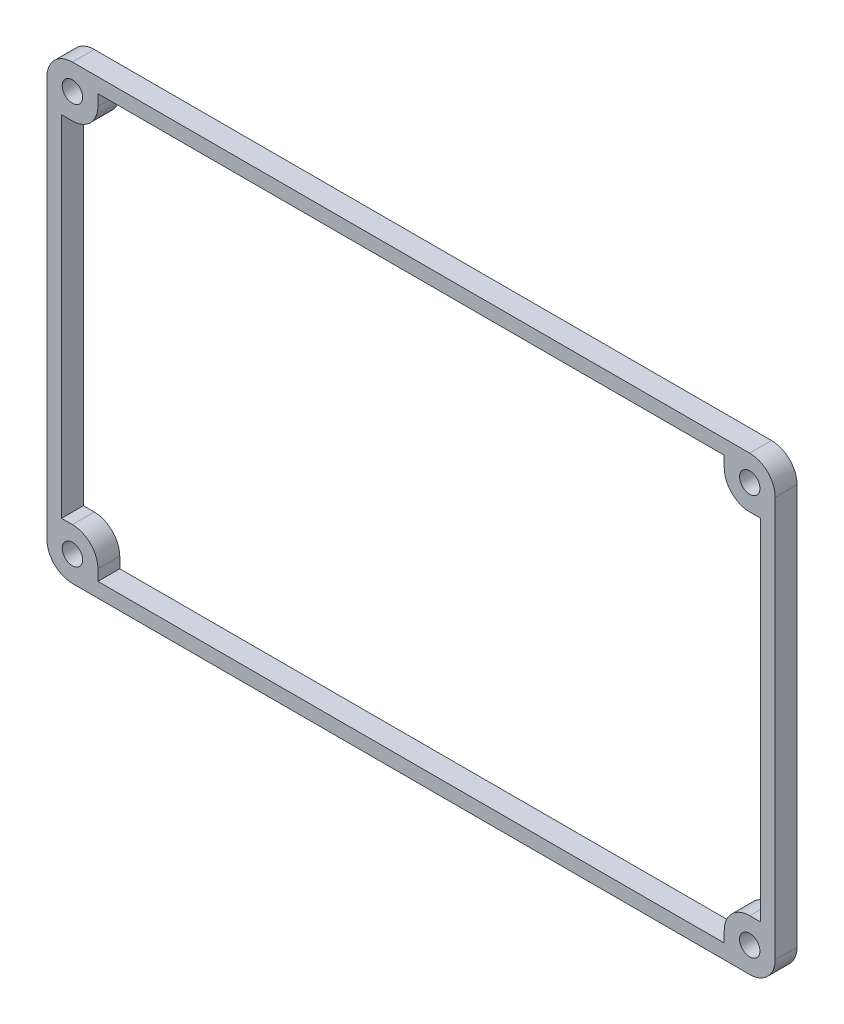
ISO-10303-21;
HEADER;
FILE_DESCRIPTION(('STEP AP214'),'2;1');
FILE_NAME('part.step','',(''),(''),'','','');
FILE_SCHEMA(('AUTOMOTIVE_DESIGN { 1 0 10303 214 1 1 1 1 }'));
ENDSEC;
DATA;
#1=APPLICATION_CONTEXT('core data for automotive mechanical design processes');
#2=APPLICATION_PROTOCOL_DEFINITION('international standard','automotive_design',2000,#1);
#3=PRODUCT_CONTEXT('',#1,'mechanical');
#4=PRODUCT('Part','Part','',(#3));
#5=PRODUCT_RELATED_PRODUCT_CATEGORY('part','',(#4));
#6=PRODUCT_DEFINITION_FORMATION('','',#4);
#7=PRODUCT_DEFINITION_CONTEXT('part definition',#1,'design');
#8=PRODUCT_DEFINITION('design','',#6,#7);
#9=PRODUCT_DEFINITION_SHAPE('','',#8);
#10=(LENGTH_UNIT() NAMED_UNIT(*) SI_UNIT(.MILLI.,.METRE.));
#11=(NAMED_UNIT(*) PLANE_ANGLE_UNIT() SI_UNIT($,.RADIAN.));
#12=(NAMED_UNIT(*) SI_UNIT($,.STERADIAN.) SOLID_ANGLE_UNIT());
#13=UNCERTAINTY_MEASURE_WITH_UNIT(LENGTH_MEASURE(1.E-05),#10,'distance_accuracy_value','');
#14=(GEOMETRIC_REPRESENTATION_CONTEXT(3) GLOBAL_UNCERTAINTY_ASSIGNED_CONTEXT((#13)) GLOBAL_UNIT_ASSIGNED_CONTEXT((#10,
#11,#12)) REPRESENTATION_CONTEXT('',''));
#15=CARTESIAN_POINT('',(0.,0.,0.));
#16=DIRECTION('',(0.,0.,1.));
#17=DIRECTION('',(1.,0.,0.));
#18=AXIS2_PLACEMENT_3D('',#15,#16,#17);
#19=CARTESIAN_POINT('',(-46.5,-27.5,3.));
#20=DIRECTION('',(0.,0.,-1.));
#21=DIRECTION('',(-1.,0.,0.));
#22=AXIS2_PLACEMENT_3D('',#19,#20,#21);
#23=PLANE('',#22);
#24=CARTESIAN_POINT('',(-46.5,-27.5,3.));
#25=DIRECTION('',(0.,0.,1.));
#26=DIRECTION('',(1.,0.,0.));
#27=AXIS2_PLACEMENT_3D('',#24,#25,#26);
#28=CIRCLE('',#27,1.4);
#29=CARTESIAN_POINT('',(-45.1,-27.5,3.));
#30=VERTEX_POINT('',#29);
#31=EDGE_CURVE('E295',#30,#30,#28,.T.);
#32=ORIENTED_EDGE('',*,*,#31,.F.);
#33=EDGE_LOOP('',(#32));
#34=FACE_BOUND('',#33,.T.);
#35=CARTESIAN_POINT('',(46.5,-27.5,3.));
#36=DIRECTION('',(0.,0.,1.));
#37=DIRECTION('',(1.,0.,0.));
#38=AXIS2_PLACEMENT_3D('',#35,#36,#37);
#39=CIRCLE('',#38,1.4);
#40=CARTESIAN_POINT('',(47.9,-27.5,3.));
#41=VERTEX_POINT('',#40);
#42=EDGE_CURVE('E301',#41,#41,#39,.T.);
#43=ORIENTED_EDGE('',*,*,#42,.F.);
#44=EDGE_LOOP('',(#43));
#45=FACE_BOUND('',#44,.T.);
#46=CARTESIAN_POINT('',(46.5,27.5,3.));
#47=DIRECTION('',(0.,0.,1.));
#48=DIRECTION('',(1.,0.,0.));
#49=AXIS2_PLACEMENT_3D('',#46,#47,#48);
#50=CIRCLE('',#49,1.4);
#51=CARTESIAN_POINT('',(47.9,27.5,3.));
#52=VERTEX_POINT('',#51);
#53=EDGE_CURVE('E307',#52,#52,#50,.T.);
#54=ORIENTED_EDGE('',*,*,#53,.F.);
#55=EDGE_LOOP('',(#54));
#56=FACE_BOUND('',#55,.T.);
#57=CARTESIAN_POINT('',(-46.5,27.5,3.));
#58=DIRECTION('',(0.,0.,1.));
#59=DIRECTION('',(1.,0.,0.));
#60=AXIS2_PLACEMENT_3D('',#57,#58,#59);
#61=CIRCLE('',#60,1.4);
#62=CARTESIAN_POINT('',(-45.1,27.5,3.));
#63=VERTEX_POINT('',#62);
#64=EDGE_CURVE('E313',#63,#63,#61,.T.);
#65=ORIENTED_EDGE('',*,*,#64,.F.);
#66=EDGE_LOOP('',(#65));
#67=FACE_BOUND('',#66,.T.);
#68=CARTESIAN_POINT('',(-46.5,-27.5,3.));
#69=DIRECTION('',(0.,0.,1.));
#70=DIRECTION('',(-1.,0.,0.));
#71=AXIS2_PLACEMENT_3D('',#68,#69,#70);
#72=CIRCLE('',#71,3.5);
#73=CARTESIAN_POINT('',(-50.,-27.5,3.));
#74=VERTEX_POINT('',#73);
#75=CARTESIAN_POINT('',(-46.5,-31.,3.));
#76=VERTEX_POINT('',#75);
#77=EDGE_CURVE('E319',#74,#76,#72,.T.);
#78=ORIENTED_EDGE('',*,*,#77,.T.);
#79=DIRECTION('',(1.,0.,0.));
#80=VECTOR('',#79,1.);
#81=CARTESIAN_POINT('',(-46.5,-31.,3.));
#82=LINE('',#81,#80);
#83=CARTESIAN_POINT('',(46.5,-31.,3.));
#84=VERTEX_POINT('',#83);
#85=EDGE_CURVE('E322',#76,#84,#82,.T.);
#86=ORIENTED_EDGE('',*,*,#85,.T.);
#87=CARTESIAN_POINT('',(46.5,-27.5,3.));
#88=DIRECTION('',(0.,0.,1.));
#89=DIRECTION('',(1.,0.,0.));
#90=AXIS2_PLACEMENT_3D('',#87,#88,#89);
#91=CIRCLE('',#90,3.5);
#92=CARTESIAN_POINT('',(50.,-27.5,3.));
#93=VERTEX_POINT('',#92);
#94=EDGE_CURVE('E325',#84,#93,#91,.T.);
#95=ORIENTED_EDGE('',*,*,#94,.T.);
#96=DIRECTION('',(0.,1.,0.));
#97=VECTOR('',#96,1.);
#98=CARTESIAN_POINT('',(50.,-27.5,3.));
#99=LINE('',#98,#97);
#100=CARTESIAN_POINT('',(50.,27.5,3.));
#101=VERTEX_POINT('',#100);
#102=EDGE_CURVE('E327',#93,#101,#99,.T.);
#103=ORIENTED_EDGE('',*,*,#102,.T.);
#104=CARTESIAN_POINT('',(46.5,27.5,3.));
#105=DIRECTION('',(0.,0.,1.));
#106=DIRECTION('',(-1.,0.,0.));
#107=AXIS2_PLACEMENT_3D('',#104,#105,#106);
#108=CIRCLE('',#107,3.5);
#109=CARTESIAN_POINT('',(46.5,31.,3.));
#110=VERTEX_POINT('',#109);
#111=EDGE_CURVE('E329',#101,#110,#108,.T.);
#112=ORIENTED_EDGE('',*,*,#111,.T.);
#113=DIRECTION('',(-1.,0.,0.));
#114=VECTOR('',#113,1.);
#115=CARTESIAN_POINT('',(-46.5,31.,3.));
#116=LINE('',#115,#114);
#117=CARTESIAN_POINT('',(-46.5,31.,3.));
#118=VERTEX_POINT('',#117);
#119=EDGE_CURVE('E331',#110,#118,#116,.T.);
#120=ORIENTED_EDGE('',*,*,#119,.T.);
#121=CARTESIAN_POINT('',(-46.5,27.5,3.));
#122=DIRECTION('',(0.,0.,1.));
#123=DIRECTION('',(-1.,0.,0.));
#124=AXIS2_PLACEMENT_3D('',#121,#122,#123);
#125=CIRCLE('',#124,3.5);
#126=CARTESIAN_POINT('',(-50.,27.5,3.));
#127=VERTEX_POINT('',#126);
#128=EDGE_CURVE('E333',#118,#127,#125,.T.);
#129=ORIENTED_EDGE('',*,*,#128,.T.);
#130=DIRECTION('',(0.,-1.,0.));
#131=VECTOR('',#130,1.);
#132=CARTESIAN_POINT('',(-50.,-27.5,3.));
#133=LINE('',#132,#131);
#134=EDGE_CURVE('E335',#127,#74,#133,.T.);
#135=ORIENTED_EDGE('',*,*,#134,.T.);
#136=EDGE_LOOP('',(#78,#86,#95,#103,#112,#120,#129,#135));
#137=FACE_BOUND('',#136,.T.);
#138=DIRECTION('',(0.,1.,0.));
#139=VECTOR('',#138,1.);
#140=CARTESIAN_POINT('',(-43.,0.,3.));
#141=LINE('',#140,#139);
#142=CARTESIAN_POINT('',(-43.,-29.,3.));
#143=VERTEX_POINT('',#142);
#144=CARTESIAN_POINT('',(-43.,-27.5,3.));
#145=VERTEX_POINT('',#144);
#146=EDGE_CURVE('E257',#143,#145,#141,.T.);
#147=ORIENTED_EDGE('',*,*,#146,.T.);
#148=CARTESIAN_POINT('',(-46.5,-27.5,3.));
#149=DIRECTION('',(0.,0.,-1.));
#150=DIRECTION('',(-1.,0.,0.));
#151=AXIS2_PLACEMENT_3D('',#148,#149,#150);
#152=CIRCLE('',#151,3.5);
#153=CARTESIAN_POINT('',(-46.5,-24.,3.));
#154=VERTEX_POINT('',#153);
#155=EDGE_CURVE('E385',#145,#154,#152,.F.);
#156=ORIENTED_EDGE('',*,*,#155,.T.);
#157=DIRECTION('',(1.,0.,0.));
#158=VECTOR('',#157,1.);
#159=CARTESIAN_POINT('',(0.,-24.,3.));
#160=LINE('',#159,#158);
#161=CARTESIAN_POINT('',(-48.,-24.,3.));
#162=VERTEX_POINT('',#161);
#163=EDGE_CURVE('E254',#162,#154,#160,.T.);
#164=ORIENTED_EDGE('',*,*,#163,.F.);
#165=DIRECTION('',(0.,1.,0.));
#166=VECTOR('',#165,1.);
#167=CARTESIAN_POINT('',(-48.,0.,3.));
#168=LINE('',#167,#166);
#169=CARTESIAN_POINT('',(-48.,24.,3.));
#170=VERTEX_POINT('',#169);
#171=EDGE_CURVE('E252',#162,#170,#168,.T.);
#172=ORIENTED_EDGE('',*,*,#171,.T.);
#173=DIRECTION('',(1.,0.,0.));
#174=VECTOR('',#173,1.);
#175=CARTESIAN_POINT('',(0.,24.,3.));
#176=LINE('',#175,#174);
#177=CARTESIAN_POINT('',(-46.5,24.,3.));
#178=VERTEX_POINT('',#177);
#179=EDGE_CURVE('E216',#170,#178,#176,.T.);
#180=ORIENTED_EDGE('',*,*,#179,.T.);
#181=CARTESIAN_POINT('',(-46.5,27.5,3.));
#182=DIRECTION('',(0.,0.,-1.));
#183=DIRECTION('',(-1.,0.,0.));
#184=AXIS2_PLACEMENT_3D('',#181,#182,#183);
#185=CIRCLE('',#184,3.5);
#186=CARTESIAN_POINT('',(-43.,27.5,3.));
#187=VERTEX_POINT('',#186);
#188=EDGE_CURVE('E379',#178,#187,#185,.F.);
#189=ORIENTED_EDGE('',*,*,#188,.T.);
#190=DIRECTION('',(0.,1.,0.));
#191=VECTOR('',#190,1.);
#192=CARTESIAN_POINT('',(-43.,0.,3.));
#193=LINE('',#192,#191);
#194=CARTESIAN_POINT('',(-43.,29.,3.));
#195=VERTEX_POINT('',#194);
#196=EDGE_CURVE('E223',#187,#195,#193,.T.);
#197=ORIENTED_EDGE('',*,*,#196,.T.);
#198=DIRECTION('',(1.,0.,0.));
#199=VECTOR('',#198,1.);
#200=CARTESIAN_POINT('',(0.,29.,3.));
#201=LINE('',#200,#199);
#202=CARTESIAN_POINT('',(43.,29.,3.));
#203=VERTEX_POINT('',#202);
#204=EDGE_CURVE('E225',#195,#203,#201,.T.);
#205=ORIENTED_EDGE('',*,*,#204,.T.);
#206=DIRECTION('',(0.,1.,0.));
#207=VECTOR('',#206,1.);
#208=CARTESIAN_POINT('',(43.,0.,3.));
#209=LINE('',#208,#207);
#210=CARTESIAN_POINT('',(43.,27.5,3.));
#211=VERTEX_POINT('',#210);
#212=EDGE_CURVE('E273',#211,#203,#209,.T.);
#213=ORIENTED_EDGE('',*,*,#212,.F.);
#214=CARTESIAN_POINT('',(46.5,27.5,3.));
#215=DIRECTION('',(0.,0.,-1.));
#216=DIRECTION('',(-1.,0.,0.));
#217=AXIS2_PLACEMENT_3D('',#214,#215,#216);
#218=CIRCLE('',#217,3.5);
#219=CARTESIAN_POINT('',(46.5,24.,3.));
#220=VERTEX_POINT('',#219);
#221=EDGE_CURVE('E381',#211,#220,#218,.F.);
#222=ORIENTED_EDGE('',*,*,#221,.T.);
#223=DIRECTION('',(1.,0.,0.));
#224=VECTOR('',#223,1.);
#225=CARTESIAN_POINT('',(0.,24.,3.));
#226=LINE('',#225,#224);
#227=CARTESIAN_POINT('',(48.,24.,3.));
#228=VERTEX_POINT('',#227);
#229=EDGE_CURVE('E271',#220,#228,#226,.T.);
#230=ORIENTED_EDGE('',*,*,#229,.T.);
#231=DIRECTION('',(0.,1.,0.));
#232=VECTOR('',#231,1.);
#233=CARTESIAN_POINT('',(48.,0.,3.));
#234=LINE('',#233,#232);
#235=CARTESIAN_POINT('',(48.,-24.,3.));
#236=VERTEX_POINT('',#235);
#237=EDGE_CURVE('E268',#236,#228,#234,.T.);
#238=ORIENTED_EDGE('',*,*,#237,.F.);
#239=DIRECTION('',(1.,0.,0.));
#240=VECTOR('',#239,1.);
#241=CARTESIAN_POINT('',(0.,-24.,3.));
#242=LINE('',#241,#240);
#243=CARTESIAN_POINT('',(46.5,-24.,3.));
#244=VERTEX_POINT('',#243);
#245=EDGE_CURVE('E266',#244,#236,#242,.T.);
#246=ORIENTED_EDGE('',*,*,#245,.F.);
#247=CARTESIAN_POINT('',(46.5,-27.5,3.));
#248=DIRECTION('',(0.,0.,-1.));
#249=DIRECTION('',(-1.,0.,0.));
#250=AXIS2_PLACEMENT_3D('',#247,#248,#249);
#251=CIRCLE('',#250,3.5);
#252=CARTESIAN_POINT('',(43.,-27.5,3.));
#253=VERTEX_POINT('',#252);
#254=EDGE_CURVE('E383',#244,#253,#251,.F.);
#255=ORIENTED_EDGE('',*,*,#254,.T.);
#256=DIRECTION('',(0.,1.,0.));
#257=VECTOR('',#256,1.);
#258=CARTESIAN_POINT('',(43.,0.,3.));
#259=LINE('',#258,#257);
#260=CARTESIAN_POINT('',(43.,-29.,3.));
#261=VERTEX_POINT('',#260);
#262=EDGE_CURVE('E263',#261,#253,#259,.T.);
#263=ORIENTED_EDGE('',*,*,#262,.F.);
#264=DIRECTION('',(1.,0.,0.));
#265=VECTOR('',#264,1.);
#266=CARTESIAN_POINT('',(0.,-29.,3.));
#267=LINE('',#266,#265);
#268=EDGE_CURVE('E260',#143,#261,#267,.T.);
#269=ORIENTED_EDGE('',*,*,#268,.F.);
#270=EDGE_LOOP('',(#147,#156,#164,#172,#180,#189,#197,#205,#213,#222,#230,#238,#246,#255,#263,#269));
#271=FACE_BOUND('',#270,.T.);
#272=ADVANCED_FACE('F36',(#34,#45,#56,#67,#137,#271),#23,.F.);
#273=CARTESIAN_POINT('',(-46.5,-27.5,0.));
#274=DIRECTION('',(0.,0.,-1.));
#275=DIRECTION('',(-1.,0.,0.));
#276=AXIS2_PLACEMENT_3D('',#273,#274,#275);
#277=PLANE('',#276);
#278=CARTESIAN_POINT('',(46.5,-27.5,0.));
#279=DIRECTION('',(0.,0.,1.));
#280=DIRECTION('',(1.,0.,0.));
#281=AXIS2_PLACEMENT_3D('',#278,#279,#280);
#282=CIRCLE('',#281,1.4);
#283=CARTESIAN_POINT('',(47.9,-27.5,0.));
#284=VERTEX_POINT('',#283);
#285=EDGE_CURVE('E298',#284,#284,#282,.T.);
#286=ORIENTED_EDGE('',*,*,#285,.T.);
#287=EDGE_LOOP('',(#286));
#288=FACE_BOUND('',#287,.T.);
#289=CARTESIAN_POINT('',(-46.5,27.5,0.));
#290=DIRECTION('',(0.,0.,1.));
#291=DIRECTION('',(1.,0.,0.));
#292=AXIS2_PLACEMENT_3D('',#289,#290,#291);
#293=CIRCLE('',#292,1.4);
#294=CARTESIAN_POINT('',(-45.1,27.5,0.));
#295=VERTEX_POINT('',#294);
#296=EDGE_CURVE('E310',#295,#295,#293,.T.);
#297=ORIENTED_EDGE('',*,*,#296,.T.);
#298=EDGE_LOOP('',(#297));
#299=FACE_BOUND('',#298,.T.);
#300=CARTESIAN_POINT('',(-46.5,-27.5,0.));
#301=DIRECTION('',(0.,0.,1.));
#302=DIRECTION('',(-1.,0.,0.));
#303=AXIS2_PLACEMENT_3D('',#300,#301,#302);
#304=CIRCLE('',#303,3.5);
#305=CARTESIAN_POINT('',(-50.,-27.5,0.));
#306=VERTEX_POINT('',#305);
#307=CARTESIAN_POINT('',(-46.5,-31.,0.));
#308=VERTEX_POINT('',#307);
#309=EDGE_CURVE('E316',#306,#308,#304,.T.);
#310=ORIENTED_EDGE('',*,*,#309,.F.);
#311=DIRECTION('',(0.,-1.,0.));
#312=VECTOR('',#311,1.);
#313=CARTESIAN_POINT('',(-50.,-27.5,0.));
#314=LINE('',#313,#312);
#315=CARTESIAN_POINT('',(-50.,27.5,0.));
#316=VERTEX_POINT('',#315);
#317=EDGE_CURVE('E323',#316,#306,#314,.T.);
#318=ORIENTED_EDGE('',*,*,#317,.F.);
#319=CARTESIAN_POINT('',(-46.5,27.5,0.));
#320=DIRECTION('',(0.,0.,1.));
#321=DIRECTION('',(-1.,0.,0.));
#322=AXIS2_PLACEMENT_3D('',#319,#320,#321);
#323=CIRCLE('',#322,3.5);
#324=CARTESIAN_POINT('',(-46.5,31.,0.));
#325=VERTEX_POINT('',#324);
#326=EDGE_CURVE('E350',#325,#316,#323,.T.);
#327=ORIENTED_EDGE('',*,*,#326,.F.);
#328=DIRECTION('',(-1.,0.,0.));
#329=VECTOR('',#328,1.);
#330=CARTESIAN_POINT('',(-46.5,31.,0.));
#331=LINE('',#330,#329);
#332=CARTESIAN_POINT('',(46.5,31.,0.));
#333=VERTEX_POINT('',#332);
#334=EDGE_CURVE('E348',#333,#325,#331,.T.);
#335=ORIENTED_EDGE('',*,*,#334,.F.);
#336=CARTESIAN_POINT('',(46.5,27.5,0.));
#337=DIRECTION('',(0.,0.,1.));
#338=DIRECTION('',(-1.,0.,0.));
#339=AXIS2_PLACEMENT_3D('',#336,#337,#338);
#340=CIRCLE('',#339,3.5);
#341=CARTESIAN_POINT('',(50.,27.5,0.));
#342=VERTEX_POINT('',#341);
#343=EDGE_CURVE('E346',#342,#333,#340,.T.);
#344=ORIENTED_EDGE('',*,*,#343,.F.);
#345=DIRECTION('',(0.,1.,0.));
#346=VECTOR('',#345,1.);
#347=CARTESIAN_POINT('',(50.,-27.5,0.));
#348=LINE('',#347,#346);
#349=CARTESIAN_POINT('',(50.,-27.5,0.));
#350=VERTEX_POINT('',#349);
#351=EDGE_CURVE('E344',#350,#342,#348,.T.);
#352=ORIENTED_EDGE('',*,*,#351,.F.);
#353=CARTESIAN_POINT('',(46.5,-27.5,0.));
#354=DIRECTION('',(0.,0.,1.));
#355=DIRECTION('',(1.,0.,0.));
#356=AXIS2_PLACEMENT_3D('',#353,#354,#355);
#357=CIRCLE('',#356,3.5);
#358=CARTESIAN_POINT('',(46.5,-31.,0.));
#359=VERTEX_POINT('',#358);
#360=EDGE_CURVE('E342',#359,#350,#357,.T.);
#361=ORIENTED_EDGE('',*,*,#360,.F.);
#362=DIRECTION('',(1.,0.,0.));
#363=VECTOR('',#362,1.);
#364=CARTESIAN_POINT('',(-46.5,-31.,0.));
#365=LINE('',#364,#363);
#366=EDGE_CURVE('E340',#308,#359,#365,.T.);
#367=ORIENTED_EDGE('',*,*,#366,.F.);
#368=EDGE_LOOP('',(#310,#318,#327,#335,#344,#352,#361,#367));
#369=FACE_BOUND('',#368,.T.);
#370=CARTESIAN_POINT('',(46.5,27.5,0.));
#371=DIRECTION('',(0.,0.,1.));
#372=DIRECTION('',(1.,0.,0.));
#373=AXIS2_PLACEMENT_3D('',#370,#371,#372);
#374=CIRCLE('',#373,1.4);
#375=CARTESIAN_POINT('',(47.9,27.5,0.));
#376=VERTEX_POINT('',#375);
#377=EDGE_CURVE('E304',#376,#376,#374,.T.);
#378=ORIENTED_EDGE('',*,*,#377,.T.);
#379=EDGE_LOOP('',(#378));
#380=FACE_BOUND('',#379,.T.);
#381=CARTESIAN_POINT('',(-46.5,-27.5,0.));
#382=DIRECTION('',(0.,0.,1.));
#383=DIRECTION('',(1.,0.,0.));
#384=AXIS2_PLACEMENT_3D('',#381,#382,#383);
#385=CIRCLE('',#384,1.4);
#386=CARTESIAN_POINT('',(-45.1,-27.5,0.));
#387=VERTEX_POINT('',#386);
#388=EDGE_CURVE('E280',#387,#387,#385,.T.);
#389=ORIENTED_EDGE('',*,*,#388,.T.);
#390=EDGE_LOOP('',(#389));
#391=FACE_BOUND('',#390,.T.);
#392=DIRECTION('',(1.,0.,0.));
#393=VECTOR('',#392,1.);
#394=CARTESIAN_POINT('',(0.,-24.,0.));
#395=LINE('',#394,#393);
#396=CARTESIAN_POINT('',(-48.,-24.,0.));
#397=VERTEX_POINT('',#396);
#398=CARTESIAN_POINT('',(-46.5,-24.,0.));
#399=VERTEX_POINT('',#398);
#400=EDGE_CURVE('E207',#397,#399,#395,.T.);
#401=ORIENTED_EDGE('',*,*,#400,.T.);
#402=CARTESIAN_POINT('',(-46.5,-27.5,0.));
#403=DIRECTION('',(0.,0.,-1.));
#404=DIRECTION('',(-1.,0.,0.));
#405=AXIS2_PLACEMENT_3D('',#402,#403,#404);
#406=CIRCLE('',#405,3.5);
#407=CARTESIAN_POINT('',(-43.,-27.5,0.));
#408=VERTEX_POINT('',#407);
#409=EDGE_CURVE('E393',#399,#408,#406,.T.);
#410=ORIENTED_EDGE('',*,*,#409,.T.);
#411=DIRECTION('',(0.,1.,0.));
#412=VECTOR('',#411,1.);
#413=CARTESIAN_POINT('',(-43.,0.,0.));
#414=LINE('',#413,#412);
#415=CARTESIAN_POINT('',(-43.,-29.,0.));
#416=VERTEX_POINT('',#415);
#417=EDGE_CURVE('E229',#416,#408,#414,.T.);
#418=ORIENTED_EDGE('',*,*,#417,.F.);
#419=DIRECTION('',(1.,0.,0.));
#420=VECTOR('',#419,1.);
#421=CARTESIAN_POINT('',(0.,-29.,0.));
#422=LINE('',#421,#420);
#423=CARTESIAN_POINT('',(43.,-29.,0.));
#424=VERTEX_POINT('',#423);
#425=EDGE_CURVE('E232',#416,#424,#422,.T.);
#426=ORIENTED_EDGE('',*,*,#425,.T.);
#427=DIRECTION('',(0.,1.,0.));
#428=VECTOR('',#427,1.);
#429=CARTESIAN_POINT('',(43.,0.,0.));
#430=LINE('',#429,#428);
#431=CARTESIAN_POINT('',(43.,-27.5,0.));
#432=VERTEX_POINT('',#431);
#433=EDGE_CURVE('E235',#424,#432,#430,.T.);
#434=ORIENTED_EDGE('',*,*,#433,.T.);
#435=CARTESIAN_POINT('',(46.5,-27.5,0.));
#436=DIRECTION('',(0.,0.,-1.));
#437=DIRECTION('',(-1.,0.,0.));
#438=AXIS2_PLACEMENT_3D('',#435,#436,#437);
#439=CIRCLE('',#438,3.5);
#440=CARTESIAN_POINT('',(46.5,-24.,0.));
#441=VERTEX_POINT('',#440);
#442=EDGE_CURVE('E391',#432,#441,#439,.T.);
#443=ORIENTED_EDGE('',*,*,#442,.T.);
#444=DIRECTION('',(1.,0.,0.));
#445=VECTOR('',#444,1.);
#446=CARTESIAN_POINT('',(0.,-24.,0.));
#447=LINE('',#446,#445);
#448=CARTESIAN_POINT('',(48.,-24.,0.));
#449=VERTEX_POINT('',#448);
#450=EDGE_CURVE('E238',#441,#449,#447,.T.);
#451=ORIENTED_EDGE('',*,*,#450,.T.);
#452=DIRECTION('',(0.,1.,0.));
#453=VECTOR('',#452,1.);
#454=CARTESIAN_POINT('',(48.,0.,0.));
#455=LINE('',#454,#453);
#456=CARTESIAN_POINT('',(48.,24.,0.));
#457=VERTEX_POINT('',#456);
#458=EDGE_CURVE('E240',#449,#457,#455,.T.);
#459=ORIENTED_EDGE('',*,*,#458,.T.);
#460=DIRECTION('',(1.,0.,0.));
#461=VECTOR('',#460,1.);
#462=CARTESIAN_POINT('',(0.,24.,0.));
#463=LINE('',#462,#461);
#464=CARTESIAN_POINT('',(46.5,24.,0.));
#465=VERTEX_POINT('',#464);
#466=EDGE_CURVE('E243',#465,#457,#463,.T.);
#467=ORIENTED_EDGE('',*,*,#466,.F.);
#468=CARTESIAN_POINT('',(46.5,27.5,0.));
#469=DIRECTION('',(0.,0.,-1.));
#470=DIRECTION('',(-1.,0.,0.));
#471=AXIS2_PLACEMENT_3D('',#468,#469,#470);
#472=CIRCLE('',#471,3.5);
#473=CARTESIAN_POINT('',(43.,27.5,0.));
#474=VERTEX_POINT('',#473);
#475=EDGE_CURVE('E51',#465,#474,#472,.T.);
#476=ORIENTED_EDGE('',*,*,#475,.T.);
#477=DIRECTION('',(0.,1.,0.));
#478=VECTOR('',#477,1.);
#479=CARTESIAN_POINT('',(43.,0.,0.));
#480=LINE('',#479,#478);
#481=CARTESIAN_POINT('',(43.,29.,0.));
#482=VERTEX_POINT('',#481);
#483=EDGE_CURVE('E245',#474,#482,#480,.T.);
#484=ORIENTED_EDGE('',*,*,#483,.T.);
#485=DIRECTION('',(1.,0.,0.));
#486=VECTOR('',#485,1.);
#487=CARTESIAN_POINT('',(0.,29.,0.));
#488=LINE('',#487,#486);
#489=CARTESIAN_POINT('',(-43.,29.,0.));
#490=VERTEX_POINT('',#489);
#491=EDGE_CURVE('E247',#490,#482,#488,.T.);
#492=ORIENTED_EDGE('',*,*,#491,.F.);
#493=DIRECTION('',(0.,1.,0.));
#494=VECTOR('',#493,1.);
#495=CARTESIAN_POINT('',(-43.,0.,0.));
#496=LINE('',#495,#494);
#497=CARTESIAN_POINT('',(-43.,27.5,0.));
#498=VERTEX_POINT('',#497);
#499=EDGE_CURVE('E217',#498,#490,#496,.T.);
#500=ORIENTED_EDGE('',*,*,#499,.F.);
#501=CARTESIAN_POINT('',(-46.5,27.5,0.));
#502=DIRECTION('',(0.,0.,-1.));
#503=DIRECTION('',(-1.,0.,0.));
#504=AXIS2_PLACEMENT_3D('',#501,#502,#503);
#505=CIRCLE('',#504,3.5);
#506=CARTESIAN_POINT('',(-46.5,24.,0.));
#507=VERTEX_POINT('',#506);
#508=EDGE_CURVE('E222',#498,#507,#505,.T.);
#509=ORIENTED_EDGE('',*,*,#508,.T.);
#510=DIRECTION('',(1.,0.,0.));
#511=VECTOR('',#510,1.);
#512=CARTESIAN_POINT('',(0.,24.,0.));
#513=LINE('',#512,#511);
#514=CARTESIAN_POINT('',(-48.,24.,0.));
#515=VERTEX_POINT('',#514);
#516=EDGE_CURVE('E208',#515,#507,#513,.T.);
#517=ORIENTED_EDGE('',*,*,#516,.F.);
#518=DIRECTION('',(0.,1.,0.));
#519=VECTOR('',#518,1.);
#520=CARTESIAN_POINT('',(-48.,0.,0.));
#521=LINE('',#520,#519);
#522=EDGE_CURVE('E198',#397,#515,#521,.T.);
#523=ORIENTED_EDGE('',*,*,#522,.F.);
#524=EDGE_LOOP('',(#401,#410,#418,#426,#434,#443,#451,#459,#467,#476,#484,#492,#500,#509,#517,#523));
#525=FACE_BOUND('',#524,.T.);
#526=ADVANCED_FACE('F219',(#288,#299,#369,#380,#391,#525),#277,.T.);
#527=CARTESIAN_POINT('',(-46.5,-27.5,3.));
#528=DIRECTION('',(0.,0.,-1.));
#529=DIRECTION('',(-1.,0.,0.));
#530=AXIS2_PLACEMENT_3D('',#527,#528,#529);
#531=CYLINDRICAL_SURFACE('',#530,3.5);
#532=ORIENTED_EDGE('',*,*,#309,.T.);
#533=DIRECTION('',(0.,0.,-1.));
#534=VECTOR('',#533,1.);
#535=CARTESIAN_POINT('',(-46.5,-31.,3.));
#536=LINE('',#535,#534);
#537=EDGE_CURVE('E373',#76,#308,#536,.T.);
#538=ORIENTED_EDGE('',*,*,#537,.F.);
#539=ORIENTED_EDGE('',*,*,#77,.F.);
#540=DIRECTION('',(0.,0.,-1.));
#541=VECTOR('',#540,1.);
#542=CARTESIAN_POINT('',(-50.,-27.5,3.));
#543=LINE('',#542,#541);
#544=EDGE_CURVE('E337',#74,#306,#543,.T.);
#545=ORIENTED_EDGE('',*,*,#544,.T.);
#546=EDGE_LOOP('',(#532,#538,#539,#545));
#547=FACE_BOUND('',#546,.T.);
#548=ADVANCED_FACE('F471',(#547),#531,.T.);
#549=CARTESIAN_POINT('',(-46.5,-31.,3.));
#550=DIRECTION('',(0.,1.,0.));
#551=DIRECTION('',(0.,0.,1.));
#552=AXIS2_PLACEMENT_3D('',#549,#550,#551);
#553=PLANE('',#552);
#554=ORIENTED_EDGE('',*,*,#366,.T.);
#555=DIRECTION('',(0.,0.,-1.));
#556=VECTOR('',#555,1.);
#557=CARTESIAN_POINT('',(46.5,-31.,3.));
#558=LINE('',#557,#556);
#559=EDGE_CURVE('E370',#84,#359,#558,.T.);
#560=ORIENTED_EDGE('',*,*,#559,.F.);
#561=ORIENTED_EDGE('',*,*,#85,.F.);
#562=ORIENTED_EDGE('',*,*,#537,.T.);
#563=EDGE_LOOP('',(#554,#560,#561,#562));
#564=FACE_BOUND('',#563,.T.);
#565=ADVANCED_FACE('F503',(#564),#553,.F.);
#566=CARTESIAN_POINT('',(46.5,-27.5,3.));
#567=DIRECTION('',(0.,0.,-1.));
#568=DIRECTION('',(-1.,0.,0.));
#569=AXIS2_PLACEMENT_3D('',#566,#567,#568);
#570=CYLINDRICAL_SURFACE('',#569,3.5);
#571=ORIENTED_EDGE('',*,*,#360,.T.);
#572=DIRECTION('',(0.,0.,-1.));
#573=VECTOR('',#572,1.);
#574=CARTESIAN_POINT('',(50.,-27.5,3.));
#575=LINE('',#574,#573);
#576=EDGE_CURVE('E367',#93,#350,#575,.T.);
#577=ORIENTED_EDGE('',*,*,#576,.F.);
#578=ORIENTED_EDGE('',*,*,#94,.F.);
#579=ORIENTED_EDGE('',*,*,#559,.T.);
#580=EDGE_LOOP('',(#571,#577,#578,#579));
#581=FACE_BOUND('',#580,.T.);
#582=ADVANCED_FACE('F499',(#581),#570,.T.);
#583=CARTESIAN_POINT('',(50.,-27.5,3.));
#584=DIRECTION('',(-1.,0.,0.));
#585=DIRECTION('',(0.,0.,1.));
#586=AXIS2_PLACEMENT_3D('',#583,#584,#585);
#587=PLANE('',#586);
#588=ORIENTED_EDGE('',*,*,#351,.T.);
#589=DIRECTION('',(0.,0.,-1.));
#590=VECTOR('',#589,1.);
#591=CARTESIAN_POINT('',(50.,27.5,3.));
#592=LINE('',#591,#590);
#593=EDGE_CURVE('E364',#101,#342,#592,.T.);
#594=ORIENTED_EDGE('',*,*,#593,.F.);
#595=ORIENTED_EDGE('',*,*,#102,.F.);
#596=ORIENTED_EDGE('',*,*,#576,.T.);
#597=EDGE_LOOP('',(#588,#594,#595,#596));
#598=FACE_BOUND('',#597,.T.);
#599=ADVANCED_FACE('F495',(#598),#587,.F.);
#600=CARTESIAN_POINT('',(46.5,27.5,3.));
#601=DIRECTION('',(0.,0.,-1.));
#602=DIRECTION('',(-1.,0.,0.));
#603=AXIS2_PLACEMENT_3D('',#600,#601,#602);
#604=CYLINDRICAL_SURFACE('',#603,3.5);
#605=ORIENTED_EDGE('',*,*,#343,.T.);
#606=DIRECTION('',(0.,0.,-1.));
#607=VECTOR('',#606,1.);
#608=CARTESIAN_POINT('',(46.5,31.,3.));
#609=LINE('',#608,#607);
#610=EDGE_CURVE('E361',#110,#333,#609,.T.);
#611=ORIENTED_EDGE('',*,*,#610,.F.);
#612=ORIENTED_EDGE('',*,*,#111,.F.);
#613=ORIENTED_EDGE('',*,*,#593,.T.);
#614=EDGE_LOOP('',(#605,#611,#612,#613));
#615=FACE_BOUND('',#614,.T.);
#616=ADVANCED_FACE('F491',(#615),#604,.T.);
#617=CARTESIAN_POINT('',(-46.5,31.,3.));
#618=DIRECTION('',(0.,-1.,0.));
#619=DIRECTION('',(0.,0.,-1.));
#620=AXIS2_PLACEMENT_3D('',#617,#618,#619);
#621=PLANE('',#620);
#622=ORIENTED_EDGE('',*,*,#334,.T.);
#623=DIRECTION('',(0.,0.,-1.));
#624=VECTOR('',#623,1.);
#625=CARTESIAN_POINT('',(-46.5,31.,3.));
#626=LINE('',#625,#624);
#627=EDGE_CURVE('E358',#118,#325,#626,.T.);
#628=ORIENTED_EDGE('',*,*,#627,.F.);
#629=ORIENTED_EDGE('',*,*,#119,.F.);
#630=ORIENTED_EDGE('',*,*,#610,.T.);
#631=EDGE_LOOP('',(#622,#628,#629,#630));
#632=FACE_BOUND('',#631,.T.);
#633=ADVANCED_FACE('F487',(#632),#621,.F.);
#634=CARTESIAN_POINT('',(-46.5,27.5,3.));
#635=DIRECTION('',(0.,0.,-1.));
#636=DIRECTION('',(-1.,0.,0.));
#637=AXIS2_PLACEMENT_3D('',#634,#635,#636);
#638=CYLINDRICAL_SURFACE('',#637,3.5);
#639=ORIENTED_EDGE('',*,*,#326,.T.);
#640=DIRECTION('',(0.,0.,-1.));
#641=VECTOR('',#640,1.);
#642=CARTESIAN_POINT('',(-50.,27.5,3.));
#643=LINE('',#642,#641);
#644=EDGE_CURVE('E355',#127,#316,#643,.T.);
#645=ORIENTED_EDGE('',*,*,#644,.F.);
#646=ORIENTED_EDGE('',*,*,#128,.F.);
#647=ORIENTED_EDGE('',*,*,#627,.T.);
#648=EDGE_LOOP('',(#639,#645,#646,#647));
#649=FACE_BOUND('',#648,.T.);
#650=ADVANCED_FACE('F483',(#649),#638,.T.);
#651=CARTESIAN_POINT('',(-50.,-27.5,3.));
#652=DIRECTION('',(1.,0.,0.));
#653=DIRECTION('',(0.,0.,-1.));
#654=AXIS2_PLACEMENT_3D('',#651,#652,#653);
#655=PLANE('',#654);
#656=ORIENTED_EDGE('',*,*,#317,.T.);
#657=ORIENTED_EDGE('',*,*,#544,.F.);
#658=ORIENTED_EDGE('',*,*,#134,.F.);
#659=ORIENTED_EDGE('',*,*,#644,.T.);
#660=EDGE_LOOP('',(#656,#657,#658,#659));
#661=FACE_BOUND('',#660,.T.);
#662=ADVANCED_FACE('F480',(#661),#655,.F.);
#663=CARTESIAN_POINT('',(-46.5,27.5,3.));
#664=DIRECTION('',(0.,0.,-1.));
#665=DIRECTION('',(-1.,0.,0.));
#666=AXIS2_PLACEMENT_3D('',#663,#664,#665);
#667=CYLINDRICAL_SURFACE('',#666,1.4);
#668=ORIENTED_EDGE('',*,*,#64,.T.);
#669=EDGE_LOOP('',(#668));
#670=FACE_BOUND('',#669,.T.);
#671=ORIENTED_EDGE('',*,*,#296,.F.);
#672=EDGE_LOOP('',(#671));
#673=FACE_BOUND('',#672,.T.);
#674=ADVANCED_FACE('F477',(#670,#673),#667,.F.);
#675=CARTESIAN_POINT('',(46.5,27.5,3.));
#676=DIRECTION('',(0.,0.,-1.));
#677=DIRECTION('',(-1.,0.,0.));
#678=AXIS2_PLACEMENT_3D('',#675,#676,#677);
#679=CYLINDRICAL_SURFACE('',#678,1.4);
#680=ORIENTED_EDGE('',*,*,#53,.T.);
#681=EDGE_LOOP('',(#680));
#682=FACE_BOUND('',#681,.T.);
#683=ORIENTED_EDGE('',*,*,#377,.F.);
#684=EDGE_LOOP('',(#683));
#685=FACE_BOUND('',#684,.T.);
#686=ADVANCED_FACE('F691',(#682,#685),#679,.F.);
#687=CARTESIAN_POINT('',(46.5,-27.5,3.));
#688=DIRECTION('',(0.,0.,-1.));
#689=DIRECTION('',(-1.,0.,0.));
#690=AXIS2_PLACEMENT_3D('',#687,#688,#689);
#691=CYLINDRICAL_SURFACE('',#690,1.4);
#692=ORIENTED_EDGE('',*,*,#42,.T.);
#693=EDGE_LOOP('',(#692));
#694=FACE_BOUND('',#693,.T.);
#695=ORIENTED_EDGE('',*,*,#285,.F.);
#696=EDGE_LOOP('',(#695));
#697=FACE_BOUND('',#696,.T.);
#698=ADVANCED_FACE('F681',(#694,#697),#691,.F.);
#699=CARTESIAN_POINT('',(-46.5,-27.5,3.));
#700=DIRECTION('',(0.,0.,-1.));
#701=DIRECTION('',(-1.,0.,0.));
#702=AXIS2_PLACEMENT_3D('',#699,#700,#701);
#703=CYLINDRICAL_SURFACE('',#702,1.4);
#704=ORIENTED_EDGE('',*,*,#31,.T.);
#705=EDGE_LOOP('',(#704));
#706=FACE_BOUND('',#705,.T.);
#707=ORIENTED_EDGE('',*,*,#388,.F.);
#708=EDGE_LOOP('',(#707));
#709=FACE_BOUND('',#708,.T.);
#710=ADVANCED_FACE('F462',(#706,#709),#703,.F.);
#711=CARTESIAN_POINT('',(0.,24.,0.));
#712=DIRECTION('',(0.,-1.,0.));
#713=DIRECTION('',(0.,0.,-1.));
#714=AXIS2_PLACEMENT_3D('',#711,#712,#713);
#715=PLANE('',#714);
#716=ORIENTED_EDGE('',*,*,#516,.T.);
#717=DIRECTION('',(0.,0.,1.));
#718=VECTOR('',#717,1.);
#719=CARTESIAN_POINT('',(-46.5,24.,0.));
#720=LINE('',#719,#718);
#721=EDGE_CURVE('E44',#507,#178,#720,.T.);
#722=ORIENTED_EDGE('',*,*,#721,.T.);
#723=ORIENTED_EDGE('',*,*,#179,.F.);
#724=DIRECTION('',(0.,0.,1.));
#725=VECTOR('',#724,1.);
#726=CARTESIAN_POINT('',(-48.,24.,0.));
#727=LINE('',#726,#725);
#728=EDGE_CURVE('E202',#515,#170,#727,.T.);
#729=ORIENTED_EDGE('',*,*,#728,.F.);
#730=EDGE_LOOP('',(#716,#722,#723,#729));
#731=FACE_BOUND('',#730,.T.);
#732=ADVANCED_FACE('F212',(#731),#715,.T.);
#733=CARTESIAN_POINT('',(-43.,0.,0.));
#734=DIRECTION('',(1.,0.,0.));
#735=DIRECTION('',(0.,0.,-1.));
#736=AXIS2_PLACEMENT_3D('',#733,#734,#735);
#737=PLANE('',#736);
#738=ORIENTED_EDGE('',*,*,#196,.F.);
#739=DIRECTION('',(0.,0.,1.));
#740=VECTOR('',#739,1.);
#741=CARTESIAN_POINT('',(-43.,27.5,0.));
#742=LINE('',#741,#740);
#743=EDGE_CURVE('E11',#187,#498,#742,.F.);
#744=ORIENTED_EDGE('',*,*,#743,.T.);
#745=ORIENTED_EDGE('',*,*,#499,.T.);
#746=DIRECTION('',(0.,0.,1.));
#747=VECTOR('',#746,1.);
#748=CARTESIAN_POINT('',(-43.,29.,0.));
#749=LINE('',#748,#747);
#750=EDGE_CURVE('E277',#490,#195,#749,.T.);
#751=ORIENTED_EDGE('',*,*,#750,.T.);
#752=EDGE_LOOP('',(#738,#744,#745,#751));
#753=FACE_BOUND('',#752,.T.);
#754=ADVANCED_FACE('F454',(#753),#737,.T.);
#755=CARTESIAN_POINT('',(0.,29.,0.));
#756=DIRECTION('',(0.,-1.,0.));
#757=DIRECTION('',(0.,0.,-1.));
#758=AXIS2_PLACEMENT_3D('',#755,#756,#757);
#759=PLANE('',#758);
#760=ORIENTED_EDGE('',*,*,#204,.F.);
#761=ORIENTED_EDGE('',*,*,#750,.F.);
#762=ORIENTED_EDGE('',*,*,#491,.T.);
#763=DIRECTION('',(0.,0.,1.));
#764=VECTOR('',#763,1.);
#765=CARTESIAN_POINT('',(43.,29.,0.));
#766=LINE('',#765,#764);
#767=EDGE_CURVE('E281',#482,#203,#766,.T.);
#768=ORIENTED_EDGE('',*,*,#767,.T.);
#769=EDGE_LOOP('',(#760,#761,#762,#768));
#770=FACE_BOUND('',#769,.T.);
#771=ADVANCED_FACE('F450',(#770),#759,.T.);
#772=CARTESIAN_POINT('',(43.,0.,0.));
#773=DIRECTION('',(1.,0.,0.));
#774=DIRECTION('',(0.,0.,-1.));
#775=AXIS2_PLACEMENT_3D('',#772,#773,#774);
#776=PLANE('',#775);
#777=ORIENTED_EDGE('',*,*,#483,.F.);
#778=DIRECTION('',(0.,0.,1.));
#779=VECTOR('',#778,1.);
#780=CARTESIAN_POINT('',(43.,27.5,3.));
#781=LINE('',#780,#779);
#782=EDGE_CURVE('E400',#474,#211,#781,.T.);
#783=ORIENTED_EDGE('',*,*,#782,.T.);
#784=ORIENTED_EDGE('',*,*,#212,.T.);
#785=ORIENTED_EDGE('',*,*,#767,.F.);
#786=EDGE_LOOP('',(#777,#783,#784,#785));
#787=FACE_BOUND('',#786,.T.);
#788=ADVANCED_FACE('F445',(#787),#776,.F.);
#789=CARTESIAN_POINT('',(0.,24.,0.));
#790=DIRECTION('',(0.,-1.,0.));
#791=DIRECTION('',(0.,0.,-1.));
#792=AXIS2_PLACEMENT_3D('',#789,#790,#791);
#793=PLANE('',#792);
#794=ORIENTED_EDGE('',*,*,#229,.F.);
#795=DIRECTION('',(0.,0.,1.));
#796=VECTOR('',#795,1.);
#797=CARTESIAN_POINT('',(46.5,24.,0.));
#798=LINE('',#797,#796);
#799=EDGE_CURVE('E59',#220,#465,#798,.F.);
#800=ORIENTED_EDGE('',*,*,#799,.T.);
#801=ORIENTED_EDGE('',*,*,#466,.T.);
#802=DIRECTION('',(0.,0.,1.));
#803=VECTOR('',#802,1.);
#804=CARTESIAN_POINT('',(48.,24.,0.));
#805=LINE('',#804,#803);
#806=EDGE_CURVE('E284',#457,#228,#805,.T.);
#807=ORIENTED_EDGE('',*,*,#806,.T.);
#808=EDGE_LOOP('',(#794,#800,#801,#807));
#809=FACE_BOUND('',#808,.T.);
#810=ADVANCED_FACE('F588',(#809),#793,.T.);
#811=CARTESIAN_POINT('',(48.,0.,0.));
#812=DIRECTION('',(1.,0.,0.));
#813=DIRECTION('',(0.,0.,-1.));
#814=AXIS2_PLACEMENT_3D('',#811,#812,#813);
#815=PLANE('',#814);
#816=ORIENTED_EDGE('',*,*,#237,.T.);
#817=ORIENTED_EDGE('',*,*,#806,.F.);
#818=ORIENTED_EDGE('',*,*,#458,.F.);
#819=DIRECTION('',(0.,0.,1.));
#820=VECTOR('',#819,1.);
#821=CARTESIAN_POINT('',(48.,-24.,0.));
#822=LINE('',#821,#820);
#823=EDGE_CURVE('E287',#449,#236,#822,.T.);
#824=ORIENTED_EDGE('',*,*,#823,.T.);
#825=EDGE_LOOP('',(#816,#817,#818,#824));
#826=FACE_BOUND('',#825,.T.);
#827=ADVANCED_FACE('F438',(#826),#815,.F.);
#828=CARTESIAN_POINT('',(0.,-24.,0.));
#829=DIRECTION('',(0.,-1.,0.));
#830=DIRECTION('',(0.,0.,-1.));
#831=AXIS2_PLACEMENT_3D('',#828,#829,#830);
#832=PLANE('',#831);
#833=ORIENTED_EDGE('',*,*,#450,.F.);
#834=DIRECTION('',(0.,0.,1.));
#835=VECTOR('',#834,1.);
#836=CARTESIAN_POINT('',(46.5,-24.,0.));
#837=LINE('',#836,#835);
#838=EDGE_CURVE('E395',#441,#244,#837,.T.);
#839=ORIENTED_EDGE('',*,*,#838,.T.);
#840=ORIENTED_EDGE('',*,*,#245,.T.);
#841=ORIENTED_EDGE('',*,*,#823,.F.);
#842=EDGE_LOOP('',(#833,#839,#840,#841));
#843=FACE_BOUND('',#842,.T.);
#844=ADVANCED_FACE('F432',(#843),#832,.F.);
#845=CARTESIAN_POINT('',(43.,0.,0.));
#846=DIRECTION('',(1.,0.,0.));
#847=DIRECTION('',(0.,0.,-1.));
#848=AXIS2_PLACEMENT_3D('',#845,#846,#847);
#849=PLANE('',#848);
#850=ORIENTED_EDGE('',*,*,#262,.T.);
#851=DIRECTION('',(0.,0.,1.));
#852=VECTOR('',#851,1.);
#853=CARTESIAN_POINT('',(43.,-27.5,0.));
#854=LINE('',#853,#852);
#855=EDGE_CURVE('E398',#253,#432,#854,.F.);
#856=ORIENTED_EDGE('',*,*,#855,.T.);
#857=ORIENTED_EDGE('',*,*,#433,.F.);
#858=DIRECTION('',(0.,0.,1.));
#859=VECTOR('',#858,1.);
#860=CARTESIAN_POINT('',(43.,-29.,0.));
#861=LINE('',#860,#859);
#862=EDGE_CURVE('E290',#424,#261,#861,.T.);
#863=ORIENTED_EDGE('',*,*,#862,.T.);
#864=EDGE_LOOP('',(#850,#856,#857,#863));
#865=FACE_BOUND('',#864,.T.);
#866=ADVANCED_FACE('F567',(#865),#849,.F.);
#867=CARTESIAN_POINT('',(0.,-29.,0.));
#868=DIRECTION('',(0.,-1.,0.));
#869=DIRECTION('',(0.,0.,-1.));
#870=AXIS2_PLACEMENT_3D('',#867,#868,#869);
#871=PLANE('',#870);
#872=ORIENTED_EDGE('',*,*,#268,.T.);
#873=ORIENTED_EDGE('',*,*,#862,.F.);
#874=ORIENTED_EDGE('',*,*,#425,.F.);
#875=DIRECTION('',(0.,0.,1.));
#876=VECTOR('',#875,1.);
#877=CARTESIAN_POINT('',(-43.,-29.,0.));
#878=LINE('',#877,#876);
#879=EDGE_CURVE('E292',#416,#143,#878,.T.);
#880=ORIENTED_EDGE('',*,*,#879,.T.);
#881=EDGE_LOOP('',(#872,#873,#874,#880));
#882=FACE_BOUND('',#881,.T.);
#883=ADVANCED_FACE('F421',(#882),#871,.F.);
#884=CARTESIAN_POINT('',(-43.,0.,0.));
#885=DIRECTION('',(1.,0.,0.));
#886=DIRECTION('',(0.,0.,-1.));
#887=AXIS2_PLACEMENT_3D('',#884,#885,#886);
#888=PLANE('',#887);
#889=ORIENTED_EDGE('',*,*,#417,.T.);
#890=DIRECTION('',(0.,0.,1.));
#891=VECTOR('',#890,1.);
#892=CARTESIAN_POINT('',(-43.,-27.5,3.));
#893=LINE('',#892,#891);
#894=EDGE_CURVE('E376',#408,#145,#893,.T.);
#895=ORIENTED_EDGE('',*,*,#894,.T.);
#896=ORIENTED_EDGE('',*,*,#146,.F.);
#897=ORIENTED_EDGE('',*,*,#879,.F.);
#898=EDGE_LOOP('',(#889,#895,#896,#897));
#899=FACE_BOUND('',#898,.T.);
#900=ADVANCED_FACE('F416',(#899),#888,.T.);
#901=CARTESIAN_POINT('',(0.,-24.,0.));
#902=DIRECTION('',(0.,-1.,0.));
#903=DIRECTION('',(0.,0.,-1.));
#904=AXIS2_PLACEMENT_3D('',#901,#902,#903);
#905=PLANE('',#904);
#906=ORIENTED_EDGE('',*,*,#163,.T.);
#907=DIRECTION('',(0.,0.,1.));
#908=VECTOR('',#907,1.);
#909=CARTESIAN_POINT('',(-46.5,-24.,0.));
#910=LINE('',#909,#908);
#911=EDGE_CURVE('E387',#154,#399,#910,.F.);
#912=ORIENTED_EDGE('',*,*,#911,.T.);
#913=ORIENTED_EDGE('',*,*,#400,.F.);
#914=DIRECTION('',(0.,0.,1.));
#915=VECTOR('',#914,1.);
#916=CARTESIAN_POINT('',(-48.,-24.,0.));
#917=LINE('',#916,#915);
#918=EDGE_CURVE('E204',#397,#162,#917,.T.);
#919=ORIENTED_EDGE('',*,*,#918,.T.);
#920=EDGE_LOOP('',(#906,#912,#913,#919));
#921=FACE_BOUND('',#920,.T.);
#922=ADVANCED_FACE('F409',(#921),#905,.F.);
#923=CARTESIAN_POINT('',(-48.,0.,0.));
#924=DIRECTION('',(1.,0.,0.));
#925=DIRECTION('',(0.,0.,-1.));
#926=AXIS2_PLACEMENT_3D('',#923,#924,#925);
#927=PLANE('',#926);
#928=ORIENTED_EDGE('',*,*,#171,.F.);
#929=ORIENTED_EDGE('',*,*,#918,.F.);
#930=ORIENTED_EDGE('',*,*,#522,.T.);
#931=ORIENTED_EDGE('',*,*,#728,.T.);
#932=EDGE_LOOP('',(#928,#929,#930,#931));
#933=FACE_BOUND('',#932,.T.);
#934=ADVANCED_FACE('F201',(#933),#927,.T.);
#935=CARTESIAN_POINT('',(-46.5,-27.5,0.));
#936=DIRECTION('',(0.,0.,-1.));
#937=DIRECTION('',(-1.,0.,0.));
#938=AXIS2_PLACEMENT_3D('',#935,#936,#937);
#939=CYLINDRICAL_SURFACE('',#938,3.5);
#940=ORIENTED_EDGE('',*,*,#409,.F.);
#941=ORIENTED_EDGE('',*,*,#911,.F.);
#942=ORIENTED_EDGE('',*,*,#155,.F.);
#943=ORIENTED_EDGE('',*,*,#894,.F.);
#944=EDGE_LOOP('',(#940,#941,#942,#943));
#945=FACE_BOUND('',#944,.T.);
#946=ADVANCED_FACE('F412',(#945),#939,.T.);
#947=CARTESIAN_POINT('',(46.5,-27.5,0.));
#948=DIRECTION('',(0.,0.,1.));
#949=DIRECTION('',(1.,0.,0.));
#950=AXIS2_PLACEMENT_3D('',#947,#948,#949);
#951=CYLINDRICAL_SURFACE('',#950,3.5);
#952=ORIENTED_EDGE('',*,*,#442,.F.);
#953=ORIENTED_EDGE('',*,*,#855,.F.);
#954=ORIENTED_EDGE('',*,*,#254,.F.);
#955=ORIENTED_EDGE('',*,*,#838,.F.);
#956=EDGE_LOOP('',(#952,#953,#954,#955));
#957=FACE_BOUND('',#956,.T.);
#958=ADVANCED_FACE('F429',(#957),#951,.T.);
#959=CARTESIAN_POINT('',(46.5,27.5,0.));
#960=DIRECTION('',(0.,0.,-1.));
#961=DIRECTION('',(-1.,0.,0.));
#962=AXIS2_PLACEMENT_3D('',#959,#960,#961);
#963=CYLINDRICAL_SURFACE('',#962,3.5);
#964=ORIENTED_EDGE('',*,*,#475,.F.);
#965=ORIENTED_EDGE('',*,*,#799,.F.);
#966=ORIENTED_EDGE('',*,*,#221,.F.);
#967=ORIENTED_EDGE('',*,*,#782,.F.);
#968=EDGE_LOOP('',(#964,#965,#966,#967));
#969=FACE_BOUND('',#968,.T.);
#970=ADVANCED_FACE('F442',(#969),#963,.T.);
#971=CARTESIAN_POINT('',(-46.5,27.5,0.));
#972=DIRECTION('',(0.,0.,1.));
#973=DIRECTION('',(1.,0.,0.));
#974=AXIS2_PLACEMENT_3D('',#971,#972,#973);
#975=CYLINDRICAL_SURFACE('',#974,3.5);
#976=ORIENTED_EDGE('',*,*,#508,.F.);
#977=ORIENTED_EDGE('',*,*,#743,.F.);
#978=ORIENTED_EDGE('',*,*,#188,.F.);
#979=ORIENTED_EDGE('',*,*,#721,.F.);
#980=EDGE_LOOP('',(#976,#977,#978,#979));
#981=FACE_BOUND('',#980,.T.);
#982=ADVANCED_FACE('F38',(#981),#975,.T.);
#983=CLOSED_SHELL('',(#272,#526,#548,#565,#582,#599,#616,#633,#650,#662,#674,#686,#698,#710,
#732,#754,#771,#788,#810,#827,#844,#866,#883,#900,#922,#934,#946,#958,#970,#982));
#984=MANIFOLD_SOLID_BREP('B2',#983);
#985=ADVANCED_BREP_SHAPE_REPRESENTATION('',(#18,#984),#14);
#986=SHAPE_DEFINITION_REPRESENTATION(#9,#985);
ENDSEC;
END-ISO-10303-21;
